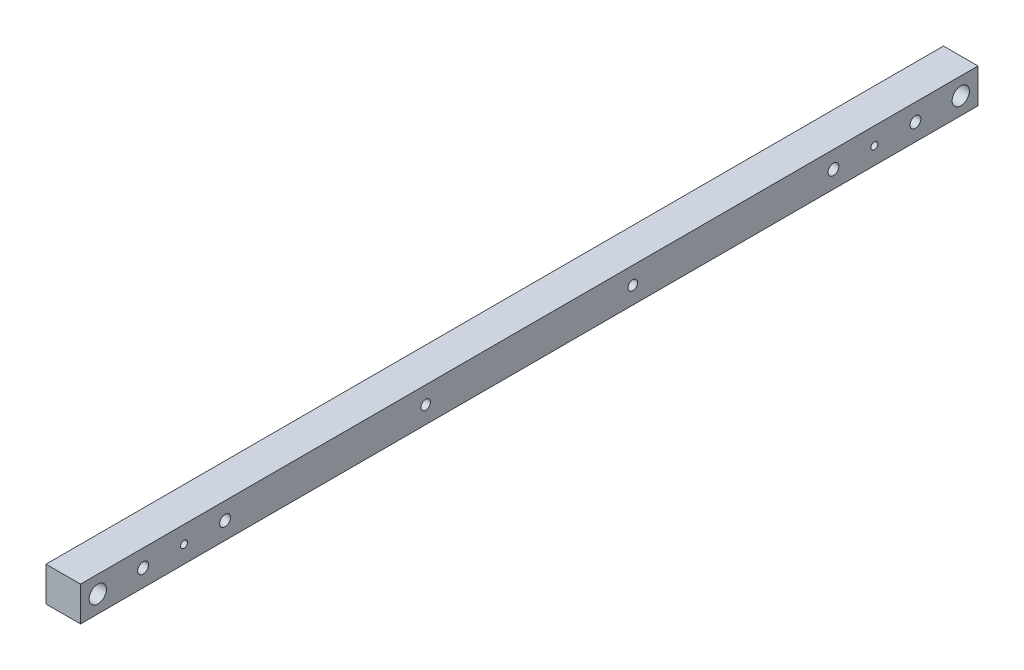
ISO-10303-21;
HEADER;
FILE_DESCRIPTION(('STEP AP214'),'2;1');
FILE_NAME('part.step','',(''),(''),'','','');
FILE_SCHEMA(('AUTOMOTIVE_DESIGN { 1 0 10303 214 1 1 1 1 }'));
ENDSEC;
DATA;
#1=APPLICATION_CONTEXT('core data for automotive mechanical design processes');
#2=APPLICATION_PROTOCOL_DEFINITION('international standard','automotive_design',2000,#1);
#3=PRODUCT_CONTEXT('',#1,'mechanical');
#4=PRODUCT('Part','Part','',(#3));
#5=PRODUCT_RELATED_PRODUCT_CATEGORY('part','',(#4));
#6=PRODUCT_DEFINITION_FORMATION('','',#4);
#7=PRODUCT_DEFINITION_CONTEXT('part definition',#1,'design');
#8=PRODUCT_DEFINITION('design','',#6,#7);
#9=PRODUCT_DEFINITION_SHAPE('','',#8);
#10=(LENGTH_UNIT() NAMED_UNIT(*) SI_UNIT(.MILLI.,.METRE.));
#11=(NAMED_UNIT(*) PLANE_ANGLE_UNIT() SI_UNIT($,.RADIAN.));
#12=(NAMED_UNIT(*) SI_UNIT($,.STERADIAN.) SOLID_ANGLE_UNIT());
#13=UNCERTAINTY_MEASURE_WITH_UNIT(LENGTH_MEASURE(1.E-05),#10,'distance_accuracy_value','');
#14=(GEOMETRIC_REPRESENTATION_CONTEXT(3) GLOBAL_UNCERTAINTY_ASSIGNED_CONTEXT((#13)) GLOBAL_UNIT_ASSIGNED_CONTEXT((#10,
#11,#12)) REPRESENTATION_CONTEXT('',''));
#15=CARTESIAN_POINT('',(0.,0.,0.));
#16=DIRECTION('',(0.,0.,1.));
#17=DIRECTION('',(1.,0.,0.));
#18=AXIS2_PLACEMENT_3D('',#15,#16,#17);
#19=CARTESIAN_POINT('',(12.7,-12.7,660.4));
#20=DIRECTION('',(-1.,0.,0.));
#21=DIRECTION('',(0.,0.,1.));
#22=AXIS2_PLACEMENT_3D('',#19,#20,#21);
#23=PLANE('',#22);
#24=CARTESIAN_POINT('',(12.7,0.,406.4));
#25=DIRECTION('',(-1.,0.,0.));
#26=DIRECTION('',(0.,0.,1.));
#27=AXIS2_PLACEMENT_3D('',#24,#25,#26);
#28=CIRCLE('',#27,3.50000000000002);
#29=CARTESIAN_POINT('',(12.7,0.,409.9));
#30=VERTEX_POINT('',#29);
#31=EDGE_CURVE('E159',#30,#30,#28,.T.);
#32=ORIENTED_EDGE('',*,*,#31,.T.);
#33=EDGE_LOOP('',(#32));
#34=FACE_BOUND('',#33,.T.);
#35=CARTESIAN_POINT('',(12.7,0.,254.));
#36=DIRECTION('',(-1.,0.,0.));
#37=DIRECTION('',(0.,0.,-1.));
#38=AXIS2_PLACEMENT_3D('',#35,#36,#37);
#39=CIRCLE('',#38,3.50000000000002);
#40=CARTESIAN_POINT('',(12.7,0.,250.5));
#41=VERTEX_POINT('',#40);
#42=EDGE_CURVE('E165',#41,#41,#39,.T.);
#43=ORIENTED_EDGE('',*,*,#42,.T.);
#44=EDGE_LOOP('',(#43));
#45=FACE_BOUND('',#44,.T.);
#46=CARTESIAN_POINT('',(12.7,0.,46.0375000000001));
#47=DIRECTION('',(-1.,0.,0.));
#48=DIRECTION('',(0.,0.,-1.));
#49=AXIS2_PLACEMENT_3D('',#46,#47,#48);
#50=CIRCLE('',#49,3.97);
#51=CARTESIAN_POINT('',(12.7,0.,42.0675000000001));
#52=VERTEX_POINT('',#51);
#53=EDGE_CURVE('E147',#52,#52,#50,.T.);
#54=ORIENTED_EDGE('',*,*,#53,.T.);
#55=EDGE_LOOP('',(#54));
#56=FACE_BOUND('',#55,.T.);
#57=CARTESIAN_POINT('',(12.7,0.,584.2));
#58=DIRECTION('',(-1.,0.,0.));
#59=DIRECTION('',(0.,0.,1.));
#60=AXIS2_PLACEMENT_3D('',#57,#58,#59);
#61=CIRCLE('',#60,2.55000000000005);
#62=CARTESIAN_POINT('',(12.7,0.,586.75));
#63=VERTEX_POINT('',#62);
#64=EDGE_CURVE('E136',#63,#63,#61,.T.);
#65=ORIENTED_EDGE('',*,*,#64,.T.);
#66=EDGE_LOOP('',(#65));
#67=FACE_BOUND('',#66,.T.);
#68=CARTESIAN_POINT('',(12.7,0.,614.3625));
#69=DIRECTION('',(-1.,0.,0.));
#70=DIRECTION('',(0.,0.,1.));
#71=AXIS2_PLACEMENT_3D('',#68,#69,#70);
#72=CIRCLE('',#71,3.97000000000004);
#73=CARTESIAN_POINT('',(12.7,0.,618.3325));
#74=VERTEX_POINT('',#73);
#75=EDGE_CURVE('E135',#74,#74,#72,.T.);
#76=ORIENTED_EDGE('',*,*,#75,.T.);
#77=EDGE_LOOP('',(#76));
#78=FACE_BOUND('',#77,.T.);
#79=CARTESIAN_POINT('',(12.7,0.,106.3625));
#80=DIRECTION('',(-1.,0.,0.));
#81=DIRECTION('',(0.,0.,-1.));
#82=AXIS2_PLACEMENT_3D('',#79,#80,#81);
#83=CIRCLE('',#82,3.96999999999999);
#84=CARTESIAN_POINT('',(12.7,0.,102.3925));
#85=VERTEX_POINT('',#84);
#86=EDGE_CURVE('E129',#85,#85,#83,.T.);
#87=ORIENTED_EDGE('',*,*,#86,.T.);
#88=EDGE_LOOP('',(#87));
#89=FACE_BOUND('',#88,.T.);
#90=CARTESIAN_POINT('',(12.7,0.,76.2));
#91=DIRECTION('',(-1.,0.,0.));
#92=DIRECTION('',(0.,0.,-1.));
#93=AXIS2_PLACEMENT_3D('',#90,#91,#92);
#94=CIRCLE('',#93,2.55000000000005);
#95=CARTESIAN_POINT('',(12.7,0.,73.65));
#96=VERTEX_POINT('',#95);
#97=EDGE_CURVE('E148',#96,#96,#94,.T.);
#98=ORIENTED_EDGE('',*,*,#97,.T.);
#99=EDGE_LOOP('',(#98));
#100=FACE_BOUND('',#99,.T.);
#101=CARTESIAN_POINT('',(12.7,0.,554.0375));
#102=DIRECTION('',(-1.,0.,0.));
#103=DIRECTION('',(0.,0.,1.));
#104=AXIS2_PLACEMENT_3D('',#101,#102,#103);
#105=CIRCLE('',#104,3.97000000000004);
#106=CARTESIAN_POINT('',(12.7,0.,558.0075));
#107=VERTEX_POINT('',#106);
#108=EDGE_CURVE('E123',#107,#107,#105,.T.);
#109=ORIENTED_EDGE('',*,*,#108,.T.);
#110=EDGE_LOOP('',(#109));
#111=FACE_BOUND('',#110,.T.);
#112=CARTESIAN_POINT('',(12.7,0.,12.7));
#113=DIRECTION('',(1.,0.,0.));
#114=DIRECTION('',(0.,0.,-1.));
#115=AXIS2_PLACEMENT_3D('',#112,#113,#114);
#116=CIRCLE('',#115,6.35);
#117=CARTESIAN_POINT('',(12.7,0.,6.35));
#118=VERTEX_POINT('',#117);
#119=EDGE_CURVE('E118',#118,#118,#116,.T.);
#120=ORIENTED_EDGE('',*,*,#119,.F.);
#121=EDGE_LOOP('',(#120));
#122=FACE_BOUND('',#121,.T.);
#123=DIRECTION('',(0.,1.,0.));
#124=VECTOR('',#123,1.);
#125=CARTESIAN_POINT('',(12.7,-12.7,0.));
#126=LINE('',#125,#124);
#127=CARTESIAN_POINT('',(12.7,-12.7,0.));
#128=VERTEX_POINT('',#127);
#129=CARTESIAN_POINT('',(12.7,12.7,0.));
#130=VERTEX_POINT('',#129);
#131=EDGE_CURVE('E104',#128,#130,#126,.T.);
#132=ORIENTED_EDGE('',*,*,#131,.T.);
#133=DIRECTION('',(0.,0.,-1.));
#134=VECTOR('',#133,1.);
#135=CARTESIAN_POINT('',(12.7,12.7,660.4));
#136=LINE('',#135,#134);
#137=CARTESIAN_POINT('',(12.7,12.7,660.4));
#138=VERTEX_POINT('',#137);
#139=EDGE_CURVE('E11',#138,#130,#136,.T.);
#140=ORIENTED_EDGE('',*,*,#139,.F.);
#141=DIRECTION('',(0.,1.,0.));
#142=VECTOR('',#141,1.);
#143=CARTESIAN_POINT('',(12.7,-12.7,660.4));
#144=LINE('',#143,#142);
#145=CARTESIAN_POINT('',(12.7,-12.7,660.4));
#146=VERTEX_POINT('',#145);
#147=EDGE_CURVE('E90',#146,#138,#144,.T.);
#148=ORIENTED_EDGE('',*,*,#147,.F.);
#149=DIRECTION('',(0.,0.,-1.));
#150=VECTOR('',#149,1.);
#151=CARTESIAN_POINT('',(12.7,-12.7,660.4));
#152=LINE('',#151,#150);
#153=EDGE_CURVE('E100',#146,#128,#152,.T.);
#154=ORIENTED_EDGE('',*,*,#153,.T.);
#155=EDGE_LOOP('',(#132,#140,#148,#154));
#156=FACE_BOUND('',#155,.T.);
#157=CARTESIAN_POINT('',(12.7,0.,647.7));
#158=DIRECTION('',(-1.,0.,0.));
#159=DIRECTION('',(0.,0.,1.));
#160=AXIS2_PLACEMENT_3D('',#157,#158,#159);
#161=CIRCLE('',#160,6.34999999999994);
#162=CARTESIAN_POINT('',(12.7,0.,654.05));
#163=VERTEX_POINT('',#162);
#164=EDGE_CURVE('E113',#163,#163,#161,.T.);
#165=ORIENTED_EDGE('',*,*,#164,.T.);
#166=EDGE_LOOP('',(#165));
#167=FACE_BOUND('',#166,.T.);
#168=ADVANCED_FACE('F37',(#34,#45,#56,#67,#78,#89,#100,#111,#122,#156,#167),#23,.F.);
#169=CARTESIAN_POINT('',(-12.7,-12.7,660.4));
#170=DIRECTION('',(1.,0.,0.));
#171=DIRECTION('',(0.,0.,-1.));
#172=AXIS2_PLACEMENT_3D('',#169,#170,#171);
#173=PLANE('',#172);
#174=CARTESIAN_POINT('',(-12.7,0.,406.4));
#175=DIRECTION('',(-1.,0.,0.));
#176=DIRECTION('',(0.,0.,1.));
#177=AXIS2_PLACEMENT_3D('',#174,#175,#176);
#178=CIRCLE('',#177,3.50000000000002);
#179=CARTESIAN_POINT('',(-12.7,0.,409.9));
#180=VERTEX_POINT('',#179);
#181=EDGE_CURVE('E168',#180,#180,#178,.T.);
#182=ORIENTED_EDGE('',*,*,#181,.F.);
#183=EDGE_LOOP('',(#182));
#184=FACE_BOUND('',#183,.T.);
#185=CARTESIAN_POINT('',(-12.7,0.,254.));
#186=DIRECTION('',(-1.,0.,0.));
#187=DIRECTION('',(0.,0.,-1.));
#188=AXIS2_PLACEMENT_3D('',#185,#186,#187);
#189=CIRCLE('',#188,3.50000000000002);
#190=CARTESIAN_POINT('',(-12.7,0.,250.5));
#191=VERTEX_POINT('',#190);
#192=EDGE_CURVE('E162',#191,#191,#189,.T.);
#193=ORIENTED_EDGE('',*,*,#192,.F.);
#194=EDGE_LOOP('',(#193));
#195=FACE_BOUND('',#194,.T.);
#196=CARTESIAN_POINT('',(-12.7,0.,46.0375000000001));
#197=DIRECTION('',(-1.,0.,0.));
#198=DIRECTION('',(0.,0.,-1.));
#199=AXIS2_PLACEMENT_3D('',#196,#197,#198);
#200=CIRCLE('',#199,3.97);
#201=CARTESIAN_POINT('',(-12.7,0.,42.0675000000001));
#202=VERTEX_POINT('',#201);
#203=EDGE_CURVE('E144',#202,#202,#200,.T.);
#204=ORIENTED_EDGE('',*,*,#203,.F.);
#205=EDGE_LOOP('',(#204));
#206=FACE_BOUND('',#205,.T.);
#207=CARTESIAN_POINT('',(-12.7,0.,584.2));
#208=DIRECTION('',(-1.,0.,0.));
#209=DIRECTION('',(0.,0.,1.));
#210=AXIS2_PLACEMENT_3D('',#207,#208,#209);
#211=CIRCLE('',#210,2.55000000000005);
#212=CARTESIAN_POINT('',(-12.7,0.,586.75));
#213=VERTEX_POINT('',#212);
#214=EDGE_CURVE('E151',#213,#213,#211,.T.);
#215=ORIENTED_EDGE('',*,*,#214,.F.);
#216=EDGE_LOOP('',(#215));
#217=FACE_BOUND('',#216,.T.);
#218=CARTESIAN_POINT('',(-12.7,0.,614.3625));
#219=DIRECTION('',(-1.,0.,0.));
#220=DIRECTION('',(0.,0.,1.));
#221=AXIS2_PLACEMENT_3D('',#218,#219,#220);
#222=CIRCLE('',#221,3.97000000000004);
#223=CARTESIAN_POINT('',(-12.7,0.,618.3325));
#224=VERTEX_POINT('',#223);
#225=EDGE_CURVE('E132',#224,#224,#222,.T.);
#226=ORIENTED_EDGE('',*,*,#225,.F.);
#227=EDGE_LOOP('',(#226));
#228=FACE_BOUND('',#227,.T.);
#229=CARTESIAN_POINT('',(-12.7,0.,106.3625));
#230=DIRECTION('',(-1.,0.,0.));
#231=DIRECTION('',(0.,0.,-1.));
#232=AXIS2_PLACEMENT_3D('',#229,#230,#231);
#233=CIRCLE('',#232,3.96999999999999);
#234=CARTESIAN_POINT('',(-12.7,0.,102.3925));
#235=VERTEX_POINT('',#234);
#236=EDGE_CURVE('E139',#235,#235,#233,.T.);
#237=ORIENTED_EDGE('',*,*,#236,.F.);
#238=EDGE_LOOP('',(#237));
#239=FACE_BOUND('',#238,.T.);
#240=CARTESIAN_POINT('',(-12.7,0.,76.2));
#241=DIRECTION('',(-1.,0.,0.));
#242=DIRECTION('',(0.,0.,-1.));
#243=AXIS2_PLACEMENT_3D('',#240,#241,#242);
#244=CIRCLE('',#243,2.55000000000005);
#245=CARTESIAN_POINT('',(-12.7,0.,73.65));
#246=VERTEX_POINT('',#245);
#247=EDGE_CURVE('E156',#246,#246,#244,.T.);
#248=ORIENTED_EDGE('',*,*,#247,.F.);
#249=EDGE_LOOP('',(#248));
#250=FACE_BOUND('',#249,.T.);
#251=CARTESIAN_POINT('',(-12.7,0.,554.0375));
#252=DIRECTION('',(-1.,0.,0.));
#253=DIRECTION('',(0.,0.,1.));
#254=AXIS2_PLACEMENT_3D('',#251,#252,#253);
#255=CIRCLE('',#254,3.97000000000004);
#256=CARTESIAN_POINT('',(-12.7,0.,558.0075));
#257=VERTEX_POINT('',#256);
#258=EDGE_CURVE('E126',#257,#257,#255,.T.);
#259=ORIENTED_EDGE('',*,*,#258,.F.);
#260=EDGE_LOOP('',(#259));
#261=FACE_BOUND('',#260,.T.);
#262=CARTESIAN_POINT('',(-12.7,0.,12.7));
#263=DIRECTION('',(1.,0.,0.));
#264=DIRECTION('',(0.,0.,-1.));
#265=AXIS2_PLACEMENT_3D('',#262,#263,#264);
#266=CIRCLE('',#265,6.35);
#267=CARTESIAN_POINT('',(-12.7,0.,6.35));
#268=VERTEX_POINT('',#267);
#269=EDGE_CURVE('E111',#268,#268,#266,.T.);
#270=ORIENTED_EDGE('',*,*,#269,.T.);
#271=EDGE_LOOP('',(#270));
#272=FACE_BOUND('',#271,.T.);
#273=DIRECTION('',(0.,-1.,0.));
#274=VECTOR('',#273,1.);
#275=CARTESIAN_POINT('',(-12.7,-12.7,0.));
#276=LINE('',#275,#274);
#277=CARTESIAN_POINT('',(-12.7,12.7,0.));
#278=VERTEX_POINT('',#277);
#279=CARTESIAN_POINT('',(-12.7,-12.7,0.));
#280=VERTEX_POINT('',#279);
#281=EDGE_CURVE('E72',#278,#280,#276,.T.);
#282=ORIENTED_EDGE('',*,*,#281,.T.);
#283=DIRECTION('',(0.,0.,-1.));
#284=VECTOR('',#283,1.);
#285=CARTESIAN_POINT('',(-12.7,-12.7,660.4));
#286=LINE('',#285,#284);
#287=CARTESIAN_POINT('',(-12.7,-12.7,660.4));
#288=VERTEX_POINT('',#287);
#289=EDGE_CURVE('E95',#288,#280,#286,.T.);
#290=ORIENTED_EDGE('',*,*,#289,.F.);
#291=DIRECTION('',(0.,-1.,0.));
#292=VECTOR('',#291,1.);
#293=CARTESIAN_POINT('',(-12.7,-12.7,660.4));
#294=LINE('',#293,#292);
#295=CARTESIAN_POINT('',(-12.7,12.7,660.4));
#296=VERTEX_POINT('',#295);
#297=EDGE_CURVE('E88',#296,#288,#294,.T.);
#298=ORIENTED_EDGE('',*,*,#297,.F.);
#299=DIRECTION('',(0.,0.,-1.));
#300=VECTOR('',#299,1.);
#301=CARTESIAN_POINT('',(-12.7,12.7,660.4));
#302=LINE('',#301,#300);
#303=EDGE_CURVE('E46',#296,#278,#302,.T.);
#304=ORIENTED_EDGE('',*,*,#303,.T.);
#305=EDGE_LOOP('',(#282,#290,#298,#304));
#306=FACE_BOUND('',#305,.T.);
#307=CARTESIAN_POINT('',(-12.7,0.,647.7));
#308=DIRECTION('',(1.,0.,0.));
#309=DIRECTION('',(0.,0.,-1.));
#310=AXIS2_PLACEMENT_3D('',#307,#308,#309);
#311=CIRCLE('',#310,6.34999999999994);
#312=CARTESIAN_POINT('',(-12.7,0.,641.35));
#313=VERTEX_POINT('',#312);
#314=EDGE_CURVE('E40',#313,#313,#311,.F.);
#315=ORIENTED_EDGE('',*,*,#314,.F.);
#316=EDGE_LOOP('',(#315));
#317=FACE_BOUND('',#316,.T.);
#318=ADVANCED_FACE('F97',(#184,#195,#206,#217,#228,#239,#250,#261,#272,#306,#317),#173,.F.);
#319=CARTESIAN_POINT('',(-12.7,12.7,660.4));
#320=DIRECTION('',(0.,-1.,0.));
#321=DIRECTION('',(0.,0.,-1.));
#322=AXIS2_PLACEMENT_3D('',#319,#320,#321);
#323=PLANE('',#322);
#324=DIRECTION('',(-1.,0.,0.));
#325=VECTOR('',#324,1.);
#326=CARTESIAN_POINT('',(-12.7,12.7,0.));
#327=LINE('',#326,#325);
#328=EDGE_CURVE('E94',#130,#278,#327,.T.);
#329=ORIENTED_EDGE('',*,*,#328,.T.);
#330=ORIENTED_EDGE('',*,*,#303,.F.);
#331=DIRECTION('',(-1.,0.,0.));
#332=VECTOR('',#331,1.);
#333=CARTESIAN_POINT('',(-12.7,12.7,660.4));
#334=LINE('',#333,#332);
#335=EDGE_CURVE('E85',#138,#296,#334,.T.);
#336=ORIENTED_EDGE('',*,*,#335,.F.);
#337=ORIENTED_EDGE('',*,*,#139,.T.);
#338=EDGE_LOOP('',(#329,#330,#336,#337));
#339=FACE_BOUND('',#338,.T.);
#340=ADVANCED_FACE('F93',(#339),#323,.F.);
#341=CARTESIAN_POINT('',(-12.7,-12.7,660.4));
#342=DIRECTION('',(0.,1.,0.));
#343=DIRECTION('',(0.,0.,1.));
#344=AXIS2_PLACEMENT_3D('',#341,#342,#343);
#345=PLANE('',#344);
#346=DIRECTION('',(1.,0.,0.));
#347=VECTOR('',#346,1.);
#348=CARTESIAN_POINT('',(-12.7,-12.7,0.));
#349=LINE('',#348,#347);
#350=EDGE_CURVE('E78',#280,#128,#349,.T.);
#351=ORIENTED_EDGE('',*,*,#350,.T.);
#352=ORIENTED_EDGE('',*,*,#153,.F.);
#353=DIRECTION('',(1.,0.,0.));
#354=VECTOR('',#353,1.);
#355=CARTESIAN_POINT('',(-12.7,-12.7,660.4));
#356=LINE('',#355,#354);
#357=EDGE_CURVE('E55',#288,#146,#356,.T.);
#358=ORIENTED_EDGE('',*,*,#357,.F.);
#359=ORIENTED_EDGE('',*,*,#289,.T.);
#360=EDGE_LOOP('',(#351,#352,#358,#359));
#361=FACE_BOUND('',#360,.T.);
#362=ADVANCED_FACE('F233',(#361),#345,.F.);
#363=CARTESIAN_POINT('',(0.,0.,660.4));
#364=DIRECTION('',(0.,0.,-1.));
#365=DIRECTION('',(-1.,0.,0.));
#366=AXIS2_PLACEMENT_3D('',#363,#364,#365);
#367=PLANE('',#366);
#368=ORIENTED_EDGE('',*,*,#147,.T.);
#369=ORIENTED_EDGE('',*,*,#335,.T.);
#370=ORIENTED_EDGE('',*,*,#297,.T.);
#371=ORIENTED_EDGE('',*,*,#357,.T.);
#372=EDGE_LOOP('',(#368,#369,#370,#371));
#373=FACE_BOUND('',#372,.T.);
#374=ADVANCED_FACE('F86',(#373),#367,.F.);
#375=CARTESIAN_POINT('',(0.,0.,0.));
#376=DIRECTION('',(0.,0.,-1.));
#377=DIRECTION('',(-1.,0.,0.));
#378=AXIS2_PLACEMENT_3D('',#375,#376,#377);
#379=PLANE('',#378);
#380=ORIENTED_EDGE('',*,*,#131,.F.);
#381=ORIENTED_EDGE('',*,*,#350,.F.);
#382=ORIENTED_EDGE('',*,*,#281,.F.);
#383=ORIENTED_EDGE('',*,*,#328,.F.);
#384=EDGE_LOOP('',(#380,#381,#382,#383));
#385=FACE_BOUND('',#384,.T.);
#386=ADVANCED_FACE('F245',(#385),#379,.T.);
#387=CARTESIAN_POINT('',(-12.700012,0.,12.7));
#388=DIRECTION('',(1.,0.,0.));
#389=DIRECTION('',(0.,0.,-1.));
#390=AXIS2_PLACEMENT_3D('',#387,#388,#389);
#391=CYLINDRICAL_SURFACE('',#390,6.35);
#392=ORIENTED_EDGE('',*,*,#119,.T.);
#393=EDGE_LOOP('',(#392));
#394=FACE_BOUND('',#393,.T.);
#395=ORIENTED_EDGE('',*,*,#269,.F.);
#396=EDGE_LOOP('',(#395));
#397=FACE_BOUND('',#396,.T.);
#398=ADVANCED_FACE('F213',(#394,#397),#391,.F.);
#399=CARTESIAN_POINT('',(-12.700012,0.,647.7));
#400=DIRECTION('',(1.,0.,0.));
#401=DIRECTION('',(0.,0.,-1.));
#402=AXIS2_PLACEMENT_3D('',#399,#400,#401);
#403=CYLINDRICAL_SURFACE('',#402,6.34999999999994);
#404=ORIENTED_EDGE('',*,*,#164,.F.);
#405=EDGE_LOOP('',(#404));
#406=FACE_BOUND('',#405,.T.);
#407=ORIENTED_EDGE('',*,*,#314,.T.);
#408=EDGE_LOOP('',(#407));
#409=FACE_BOUND('',#408,.T.);
#410=ADVANCED_FACE('F203',(#406,#409),#403,.F.);
#411=CARTESIAN_POINT('',(12.7,0.,554.0375));
#412=DIRECTION('',(-1.,0.,0.));
#413=DIRECTION('',(0.,0.,1.));
#414=AXIS2_PLACEMENT_3D('',#411,#412,#413);
#415=CYLINDRICAL_SURFACE('',#414,3.97000000000004);
#416=ORIENTED_EDGE('',*,*,#108,.F.);
#417=EDGE_LOOP('',(#416));
#418=FACE_BOUND('',#417,.T.);
#419=ORIENTED_EDGE('',*,*,#258,.T.);
#420=EDGE_LOOP('',(#419));
#421=FACE_BOUND('',#420,.T.);
#422=ADVANCED_FACE('F200',(#418,#421),#415,.F.);
#423=CARTESIAN_POINT('',(12.7,0.,76.2));
#424=DIRECTION('',(-1.,0.,0.));
#425=DIRECTION('',(0.,0.,1.));
#426=AXIS2_PLACEMENT_3D('',#423,#424,#425);
#427=CYLINDRICAL_SURFACE('',#426,2.55000000000005);
#428=ORIENTED_EDGE('',*,*,#97,.F.);
#429=EDGE_LOOP('',(#428));
#430=FACE_BOUND('',#429,.T.);
#431=ORIENTED_EDGE('',*,*,#247,.T.);
#432=EDGE_LOOP('',(#431));
#433=FACE_BOUND('',#432,.T.);
#434=ADVANCED_FACE('F202',(#430,#433),#427,.F.);
#435=CARTESIAN_POINT('',(12.7,0.,106.3625));
#436=DIRECTION('',(-1.,0.,0.));
#437=DIRECTION('',(0.,0.,1.));
#438=AXIS2_PLACEMENT_3D('',#435,#436,#437);
#439=CYLINDRICAL_SURFACE('',#438,3.96999999999999);
#440=ORIENTED_EDGE('',*,*,#86,.F.);
#441=EDGE_LOOP('',(#440));
#442=FACE_BOUND('',#441,.T.);
#443=ORIENTED_EDGE('',*,*,#236,.T.);
#444=EDGE_LOOP('',(#443));
#445=FACE_BOUND('',#444,.T.);
#446=ADVANCED_FACE('F210',(#442,#445),#439,.F.);
#447=CARTESIAN_POINT('',(12.7,0.,614.3625));
#448=DIRECTION('',(-1.,0.,0.));
#449=DIRECTION('',(0.,0.,1.));
#450=AXIS2_PLACEMENT_3D('',#447,#448,#449);
#451=CYLINDRICAL_SURFACE('',#450,3.97000000000004);
#452=ORIENTED_EDGE('',*,*,#75,.F.);
#453=EDGE_LOOP('',(#452));
#454=FACE_BOUND('',#453,.T.);
#455=ORIENTED_EDGE('',*,*,#225,.T.);
#456=EDGE_LOOP('',(#455));
#457=FACE_BOUND('',#456,.T.);
#458=ADVANCED_FACE('F283',(#454,#457),#451,.F.);
#459=CARTESIAN_POINT('',(12.7,0.,584.2));
#460=DIRECTION('',(-1.,0.,0.));
#461=DIRECTION('',(0.,0.,1.));
#462=AXIS2_PLACEMENT_3D('',#459,#460,#461);
#463=CYLINDRICAL_SURFACE('',#462,2.55000000000005);
#464=ORIENTED_EDGE('',*,*,#64,.F.);
#465=EDGE_LOOP('',(#464));
#466=FACE_BOUND('',#465,.T.);
#467=ORIENTED_EDGE('',*,*,#214,.T.);
#468=EDGE_LOOP('',(#467));
#469=FACE_BOUND('',#468,.T.);
#470=ADVANCED_FACE('F293',(#466,#469),#463,.F.);
#471=CARTESIAN_POINT('',(12.7,0.,46.0375000000001));
#472=DIRECTION('',(-1.,0.,0.));
#473=DIRECTION('',(0.,0.,1.));
#474=AXIS2_PLACEMENT_3D('',#471,#472,#473);
#475=CYLINDRICAL_SURFACE('',#474,3.97);
#476=ORIENTED_EDGE('',*,*,#53,.F.);
#477=EDGE_LOOP('',(#476));
#478=FACE_BOUND('',#477,.T.);
#479=ORIENTED_EDGE('',*,*,#203,.T.);
#480=EDGE_LOOP('',(#479));
#481=FACE_BOUND('',#480,.T.);
#482=ADVANCED_FACE('F301',(#478,#481),#475,.F.);
#483=CARTESIAN_POINT('',(12.7,0.,254.));
#484=DIRECTION('',(-1.,0.,0.));
#485=DIRECTION('',(0.,0.,1.));
#486=AXIS2_PLACEMENT_3D('',#483,#484,#485);
#487=CYLINDRICAL_SURFACE('',#486,3.50000000000002);
#488=ORIENTED_EDGE('',*,*,#42,.F.);
#489=EDGE_LOOP('',(#488));
#490=FACE_BOUND('',#489,.T.);
#491=ORIENTED_EDGE('',*,*,#192,.T.);
#492=EDGE_LOOP('',(#491));
#493=FACE_BOUND('',#492,.T.);
#494=ADVANCED_FACE('F179',(#490,#493),#487,.F.);
#495=CARTESIAN_POINT('',(12.7,0.,406.4));
#496=DIRECTION('',(-1.,0.,0.));
#497=DIRECTION('',(0.,0.,1.));
#498=AXIS2_PLACEMENT_3D('',#495,#496,#497);
#499=CYLINDRICAL_SURFACE('',#498,3.50000000000002);
#500=ORIENTED_EDGE('',*,*,#31,.F.);
#501=EDGE_LOOP('',(#500));
#502=FACE_BOUND('',#501,.T.);
#503=ORIENTED_EDGE('',*,*,#181,.T.);
#504=EDGE_LOOP('',(#503));
#505=FACE_BOUND('',#504,.T.);
#506=ADVANCED_FACE('F176',(#502,#505),#499,.F.);
#507=CLOSED_SHELL('',(#168,#318,#340,#362,#374,#386,#398,#410,#422,#434,#446,#458,#470,#482,
#494,#506));
#508=MANIFOLD_SOLID_BREP('B2',#507);
#509=ADVANCED_BREP_SHAPE_REPRESENTATION('',(#18,#508),#14);
#510=SHAPE_DEFINITION_REPRESENTATION(#9,#509);
ENDSEC;
END-ISO-10303-21;
